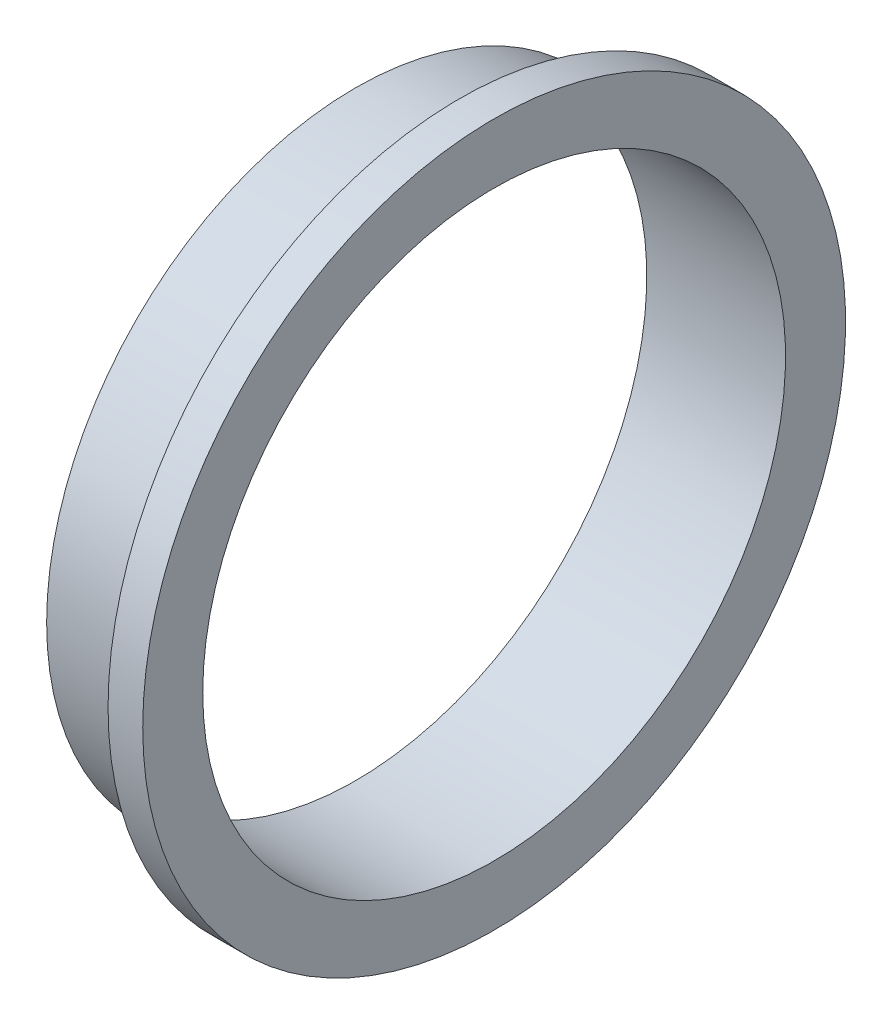
ISO-10303-21;
HEADER;
FILE_DESCRIPTION(('STEP AP214'),'2;1');
FILE_NAME('part.step','',(''),(''),'','','');
FILE_SCHEMA(('AUTOMOTIVE_DESIGN { 1 0 10303 214 1 1 1 1 }'));
ENDSEC;
DATA;
#1=APPLICATION_CONTEXT('core data for automotive mechanical design processes');
#2=APPLICATION_PROTOCOL_DEFINITION('international standard','automotive_design',2000,#1);
#3=PRODUCT_CONTEXT('',#1,'mechanical');
#4=PRODUCT('Part','Part','',(#3));
#5=PRODUCT_RELATED_PRODUCT_CATEGORY('part','',(#4));
#6=PRODUCT_DEFINITION_FORMATION('','',#4);
#7=PRODUCT_DEFINITION_CONTEXT('part definition',#1,'design');
#8=PRODUCT_DEFINITION('design','',#6,#7);
#9=PRODUCT_DEFINITION_SHAPE('','',#8);
#10=(LENGTH_UNIT() NAMED_UNIT(*) SI_UNIT(.MILLI.,.METRE.));
#11=(NAMED_UNIT(*) PLANE_ANGLE_UNIT() SI_UNIT($,.RADIAN.));
#12=(NAMED_UNIT(*) SI_UNIT($,.STERADIAN.) SOLID_ANGLE_UNIT());
#13=UNCERTAINTY_MEASURE_WITH_UNIT(LENGTH_MEASURE(1.E-05),#10,'distance_accuracy_value','');
#14=(GEOMETRIC_REPRESENTATION_CONTEXT(3) GLOBAL_UNCERTAINTY_ASSIGNED_CONTEXT((#13)) GLOBAL_UNIT_ASSIGNED_CONTEXT((#10,
#11,#12)) REPRESENTATION_CONTEXT('',''));
#15=CARTESIAN_POINT('',(0.,0.,0.));
#16=DIRECTION('',(0.,0.,1.));
#17=DIRECTION('',(1.,0.,0.));
#18=AXIS2_PLACEMENT_3D('',#15,#16,#17);
#19=CARTESIAN_POINT('',(0.,89.,0.));
#20=DIRECTION('',(1.,0.,0.));
#21=DIRECTION('',(0.,0.,-1.));
#22=AXIS2_PLACEMENT_3D('',#19,#20,#21);
#23=PLANE('',#22);
#24=CARTESIAN_POINT('',(0.,0.,0.));
#25=DIRECTION('',(-1.,0.,0.));
#26=DIRECTION('',(0.,0.,1.));
#27=AXIS2_PLACEMENT_3D('',#24,#25,#26);
#28=CIRCLE('',#27,84.);
#29=CARTESIAN_POINT('',(0.,0.,84.));
#30=VERTEX_POINT('',#29);
#31=EDGE_CURVE('E10',#30,#30,#28,.T.);
#32=ORIENTED_EDGE('',*,*,#31,.F.);
#33=EDGE_LOOP('',(#32));
#34=FACE_BOUND('',#33,.T.);
#35=CARTESIAN_POINT('',(0.,0.,0.));
#36=DIRECTION('',(-1.,0.,0.));
#37=DIRECTION('',(0.,0.,1.));
#38=AXIS2_PLACEMENT_3D('',#35,#36,#37);
#39=CIRCLE('',#38,89.);
#40=CARTESIAN_POINT('',(0.,0.,89.));
#41=VERTEX_POINT('',#40);
#42=EDGE_CURVE('E64',#41,#41,#39,.T.);
#43=ORIENTED_EDGE('',*,*,#42,.T.);
#44=EDGE_LOOP('',(#43));
#45=FACE_BOUND('',#44,.T.);
#46=ADVANCED_FACE('F37',(#34,#45),#23,.F.);
#47=CARTESIAN_POINT('',(-2.,0.,0.));
#48=DIRECTION('',(-1.,0.,0.));
#49=DIRECTION('',(0.,0.,1.));
#50=AXIS2_PLACEMENT_3D('',#47,#48,#49);
#51=CYLINDRICAL_SURFACE('',#50,84.);
#52=CARTESIAN_POINT('',(40.,0.,0.));
#53=DIRECTION('',(-1.,0.,0.));
#54=DIRECTION('',(0.,0.,1.));
#55=AXIS2_PLACEMENT_3D('',#52,#53,#54);
#56=CIRCLE('',#55,84.);
#57=CARTESIAN_POINT('',(40.,0.,84.));
#58=VERTEX_POINT('',#57);
#59=EDGE_CURVE('E44',#58,#58,#56,.T.);
#60=ORIENTED_EDGE('',*,*,#59,.F.);
#61=EDGE_LOOP('',(#60));
#62=FACE_BOUND('',#61,.T.);
#63=ORIENTED_EDGE('',*,*,#31,.T.);
#64=EDGE_LOOP('',(#63));
#65=FACE_BOUND('',#64,.T.);
#66=ADVANCED_FACE('F90',(#62,#65),#51,.F.);
#67=CARTESIAN_POINT('',(40.,84.,0.));
#68=DIRECTION('',(-1.,0.,0.));
#69=DIRECTION('',(0.,0.,1.));
#70=AXIS2_PLACEMENT_3D('',#67,#68,#69);
#71=PLANE('',#70);
#72=CARTESIAN_POINT('',(40.,0.,0.));
#73=DIRECTION('',(-1.,0.,0.));
#74=DIRECTION('',(0.,0.,1.));
#75=AXIS2_PLACEMENT_3D('',#72,#73,#74);
#76=CIRCLE('',#75,101.3);
#77=CARTESIAN_POINT('',(40.,0.,101.3));
#78=VERTEX_POINT('',#77);
#79=EDGE_CURVE('E49',#78,#78,#76,.T.);
#80=ORIENTED_EDGE('',*,*,#79,.F.);
#81=EDGE_LOOP('',(#80));
#82=FACE_BOUND('',#81,.T.);
#83=ORIENTED_EDGE('',*,*,#59,.T.);
#84=EDGE_LOOP('',(#83));
#85=FACE_BOUND('',#84,.T.);
#86=ADVANCED_FACE('F85',(#82,#85),#71,.F.);
#87=CARTESIAN_POINT('',(-2.,0.,0.));
#88=DIRECTION('',(-1.,0.,0.));
#89=DIRECTION('',(0.,0.,1.));
#90=AXIS2_PLACEMENT_3D('',#87,#88,#89);
#91=CYLINDRICAL_SURFACE('',#90,101.3);
#92=CARTESIAN_POINT('',(30.,0.,0.));
#93=DIRECTION('',(-1.,0.,0.));
#94=DIRECTION('',(0.,0.,1.));
#95=AXIS2_PLACEMENT_3D('',#92,#93,#94);
#96=CIRCLE('',#95,101.3);
#97=CARTESIAN_POINT('',(30.,0.,101.3));
#98=VERTEX_POINT('',#97);
#99=EDGE_CURVE('E54',#98,#98,#96,.T.);
#100=ORIENTED_EDGE('',*,*,#99,.F.);
#101=EDGE_LOOP('',(#100));
#102=FACE_BOUND('',#101,.T.);
#103=ORIENTED_EDGE('',*,*,#79,.T.);
#104=EDGE_LOOP('',(#103));
#105=FACE_BOUND('',#104,.T.);
#106=ADVANCED_FACE('F79',(#102,#105),#91,.T.);
#107=CARTESIAN_POINT('',(30.,89.,0.));
#108=DIRECTION('',(1.,0.,0.));
#109=DIRECTION('',(0.,0.,-1.));
#110=AXIS2_PLACEMENT_3D('',#107,#108,#109);
#111=PLANE('',#110);
#112=CARTESIAN_POINT('',(30.,0.,0.));
#113=DIRECTION('',(-1.,0.,0.));
#114=DIRECTION('',(0.,0.,1.));
#115=AXIS2_PLACEMENT_3D('',#112,#113,#114);
#116=CIRCLE('',#115,89.);
#117=CARTESIAN_POINT('',(30.,0.,89.));
#118=VERTEX_POINT('',#117);
#119=EDGE_CURVE('E60',#118,#118,#116,.T.);
#120=ORIENTED_EDGE('',*,*,#119,.F.);
#121=EDGE_LOOP('',(#120));
#122=FACE_BOUND('',#121,.T.);
#123=ORIENTED_EDGE('',*,*,#99,.T.);
#124=EDGE_LOOP('',(#123));
#125=FACE_BOUND('',#124,.T.);
#126=ADVANCED_FACE('F73',(#122,#125),#111,.F.);
#127=CARTESIAN_POINT('',(-2.,0.,0.));
#128=DIRECTION('',(-1.,0.,0.));
#129=DIRECTION('',(0.,0.,1.));
#130=AXIS2_PLACEMENT_3D('',#127,#128,#129);
#131=CYLINDRICAL_SURFACE('',#130,89.);
#132=ORIENTED_EDGE('',*,*,#42,.F.);
#133=EDGE_LOOP('',(#132));
#134=FACE_BOUND('',#133,.T.);
#135=ORIENTED_EDGE('',*,*,#119,.T.);
#136=EDGE_LOOP('',(#135));
#137=FACE_BOUND('',#136,.T.);
#138=ADVANCED_FACE('F70',(#134,#137),#131,.T.);
#139=CLOSED_SHELL('',(#46,#66,#86,#106,#126,#138));
#140=MANIFOLD_SOLID_BREP('B2',#139);
#141=ADVANCED_BREP_SHAPE_REPRESENTATION('',(#18,#140),#14);
#142=SHAPE_DEFINITION_REPRESENTATION(#9,#141);
ENDSEC;
END-ISO-10303-21;
